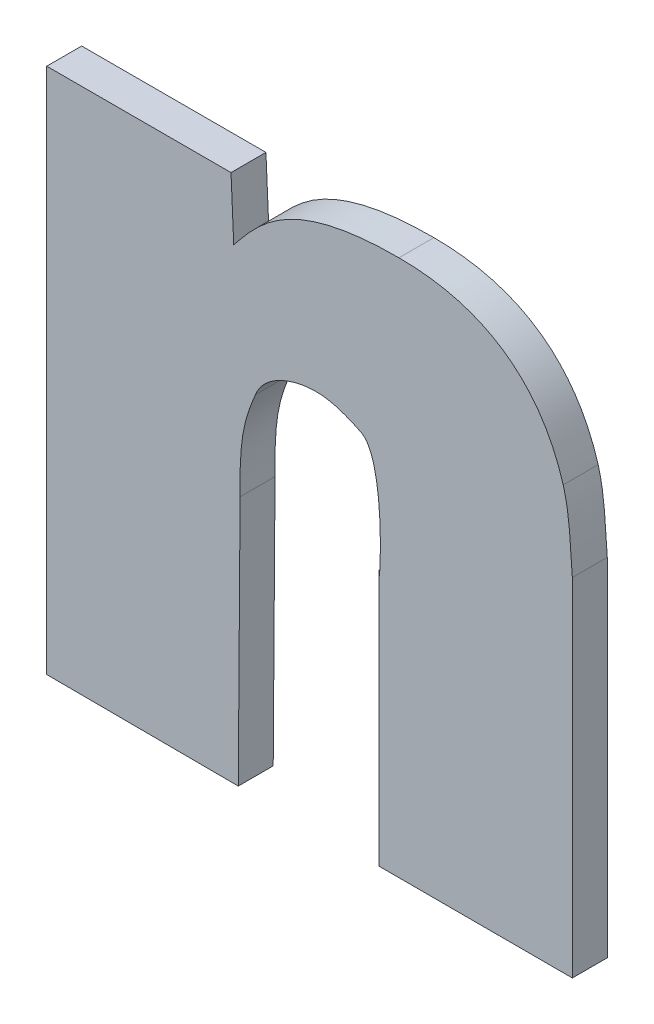
ISO-10303-21;
HEADER;
FILE_DESCRIPTION(('STEP AP214'),'2;1');
FILE_NAME('part.step','',(''),(''),'','','');
FILE_SCHEMA(('AUTOMOTIVE_DESIGN { 1 0 10303 214 1 1 1 1 }'));
ENDSEC;
DATA;
#1=APPLICATION_CONTEXT('core data for automotive mechanical design processes');
#2=APPLICATION_PROTOCOL_DEFINITION('international standard','automotive_design',2000,#1);
#3=PRODUCT_CONTEXT('',#1,'mechanical');
#4=PRODUCT('Part','Part','',(#3));
#5=PRODUCT_RELATED_PRODUCT_CATEGORY('part','',(#4));
#6=PRODUCT_DEFINITION_FORMATION('','',#4);
#7=PRODUCT_DEFINITION_CONTEXT('part definition',#1,'design');
#8=PRODUCT_DEFINITION('design','',#6,#7);
#9=PRODUCT_DEFINITION_SHAPE('','',#8);
#10=(LENGTH_UNIT() NAMED_UNIT(*) SI_UNIT(.MILLI.,.METRE.));
#11=(NAMED_UNIT(*) PLANE_ANGLE_UNIT() SI_UNIT($,.RADIAN.));
#12=(NAMED_UNIT(*) SI_UNIT($,.STERADIAN.) SOLID_ANGLE_UNIT());
#13=UNCERTAINTY_MEASURE_WITH_UNIT(LENGTH_MEASURE(1.E-05),#10,'distance_accuracy_value','');
#14=(GEOMETRIC_REPRESENTATION_CONTEXT(3) GLOBAL_UNCERTAINTY_ASSIGNED_CONTEXT((#13)) GLOBAL_UNIT_ASSIGNED_CONTEXT((#10,
#11,#12)) REPRESENTATION_CONTEXT('',''));
#15=CARTESIAN_POINT('',(0.,0.,0.));
#16=DIRECTION('',(0.,0.,1.));
#17=DIRECTION('',(1.,0.,0.));
#18=AXIS2_PLACEMENT_3D('',#15,#16,#17);
#19=CARTESIAN_POINT('',(0.173791677809616,-0.213912842174517,0.));
#20=DIRECTION('',(0.999973931858869,-0.0072204987857357,0.));
#21=DIRECTION('',(0.0072204987857357,0.999973931858869,0.));
#22=AXIS2_PLACEMENT_3D('',#19,#20,#21);
#23=PLANE('',#22);
#24=DIRECTION('',(0.0072204987857357,0.999973931858869,0.));
#25=VECTOR('',#24,1.);
#26=CARTESIAN_POINT('',(0.173791677809616,-0.213912842174517,0.));
#27=LINE('',#26,#25);
#28=CARTESIAN_POINT('',(0.173791677809616,-0.213912842174517,0.));
#29=VERTEX_POINT('',#28);
#30=CARTESIAN_POINT('',(0.173947567842768,-0.192323479165865,0.));
#31=VERTEX_POINT('',#30);
#32=EDGE_CURVE('E11',#29,#31,#27,.T.);
#33=ORIENTED_EDGE('',*,*,#32,.T.);
#34=DIRECTION('',(0.,0.,1.));
#35=VECTOR('',#34,1.);
#36=CARTESIAN_POINT('',(0.173947567842768,-0.192323479165865,0.));
#37=LINE('',#36,#35);
#38=CARTESIAN_POINT('',(0.173947567842768,-0.192323479165865,0.003));
#39=VERTEX_POINT('',#38);
#40=EDGE_CURVE('E24',#31,#39,#37,.T.);
#41=ORIENTED_EDGE('',*,*,#40,.T.);
#42=DIRECTION('',(0.0072204987857357,0.999973931858869,0.));
#43=VECTOR('',#42,1.);
#44=CARTESIAN_POINT('',(0.173791677809616,-0.213912842174517,0.003));
#45=LINE('',#44,#43);
#46=CARTESIAN_POINT('',(0.173791677809616,-0.213912842174517,0.003));
#47=VERTEX_POINT('',#46);
#48=EDGE_CURVE('E142',#47,#39,#45,.T.);
#49=ORIENTED_EDGE('',*,*,#48,.F.);
#50=DIRECTION('',(0.,0.,1.));
#51=VECTOR('',#50,1.);
#52=CARTESIAN_POINT('',(0.173791677809616,-0.213912842174517,0.));
#53=LINE('',#52,#51);
#54=EDGE_CURVE('E365',#29,#47,#53,.T.);
#55=ORIENTED_EDGE('',*,*,#54,.F.);
#56=EDGE_LOOP('',(#33,#41,#49,#55));
#57=FACE_BOUND('',#56,.T.);
#58=ADVANCED_FACE('F17',(#57),#23,.T.);
#59=CARTESIAN_POINT('',(0.157346359653284,-0.213842678823861,0.));
#60=DIRECTION('',(-0.0042664247304987,-0.999990898768593,0.));
#61=DIRECTION('',(0.999990898768593,-0.0042664247304987,0.));
#62=AXIS2_PLACEMENT_3D('',#59,#60,#61);
#63=PLANE('',#62);
#64=DIRECTION('',(0.999990898768593,-0.0042664247304987,0.));
#65=VECTOR('',#64,1.);
#66=CARTESIAN_POINT('',(0.157346359653284,-0.213842678823861,0.));
#67=LINE('',#66,#65);
#68=CARTESIAN_POINT('',(0.157346359653284,-0.213842678823861,0.));
#69=VERTEX_POINT('',#68);
#70=EDGE_CURVE('E362',#69,#29,#67,.T.);
#71=ORIENTED_EDGE('',*,*,#70,.T.);
#72=ORIENTED_EDGE('',*,*,#54,.T.);
#73=DIRECTION('',(0.999990898768593,-0.0042664247304987,0.));
#74=VECTOR('',#73,1.);
#75=CARTESIAN_POINT('',(0.157346359653284,-0.213842678823861,0.003));
#76=LINE('',#75,#74);
#77=CARTESIAN_POINT('',(0.157346359653284,-0.213842678823861,0.003));
#78=VERTEX_POINT('',#77);
#79=EDGE_CURVE('E360',#78,#47,#76,.T.);
#80=ORIENTED_EDGE('',*,*,#79,.F.);
#81=DIRECTION('',(0.,0.,1.));
#82=VECTOR('',#81,1.);
#83=CARTESIAN_POINT('',(0.157346359653284,-0.213842678823861,0.));
#84=LINE('',#83,#82);
#85=EDGE_CURVE('E357',#69,#78,#84,.T.);
#86=ORIENTED_EDGE('',*,*,#85,.F.);
#87=EDGE_LOOP('',(#71,#72,#80,#86));
#88=FACE_BOUND('',#87,.T.);
#89=ADVANCED_FACE('F449',(#88),#63,.T.);
#90=CARTESIAN_POINT('',(0.157346359653284,-0.168606341283553,0.));
#91=DIRECTION('',(-1.,0.,0.));
#92=DIRECTION('',(0.,-1.,0.));
#93=AXIS2_PLACEMENT_3D('',#90,#91,#92);
#94=PLANE('',#93);
#95=DIRECTION('',(0.,-1.,0.));
#96=VECTOR('',#95,1.);
#97=CARTESIAN_POINT('',(0.157346359653284,-0.168606341283553,0.));
#98=LINE('',#97,#96);
#99=CARTESIAN_POINT('',(0.157346359653284,-0.168606341283553,0.));
#100=VERTEX_POINT('',#99);
#101=EDGE_CURVE('E354',#100,#69,#98,.T.);
#102=ORIENTED_EDGE('',*,*,#101,.T.);
#103=ORIENTED_EDGE('',*,*,#85,.T.);
#104=DIRECTION('',(0.,-1.,0.));
#105=VECTOR('',#104,1.);
#106=CARTESIAN_POINT('',(0.157346359653284,-0.168606341283553,0.003));
#107=LINE('',#106,#105);
#108=CARTESIAN_POINT('',(0.157346359653284,-0.168606341283553,0.003));
#109=VERTEX_POINT('',#108);
#110=EDGE_CURVE('E351',#109,#78,#107,.T.);
#111=ORIENTED_EDGE('',*,*,#110,.F.);
#112=DIRECTION('',(0.,0.,1.));
#113=VECTOR('',#112,1.);
#114=CARTESIAN_POINT('',(0.157346359653284,-0.168606341283553,0.));
#115=LINE('',#114,#113);
#116=EDGE_CURVE('E348',#100,#109,#115,.T.);
#117=ORIENTED_EDGE('',*,*,#116,.F.);
#118=EDGE_LOOP('',(#102,#103,#111,#117));
#119=FACE_BOUND('',#118,.T.);
#120=ADVANCED_FACE('F453',(#119),#94,.T.);
#121=CARTESIAN_POINT('',(0.173168171159204,-0.168606341283553,0.));
#122=DIRECTION('',(0.,1.,0.));
#123=DIRECTION('',(-1.,0.,0.));
#124=AXIS2_PLACEMENT_3D('',#121,#122,#123);
#125=PLANE('',#124);
#126=DIRECTION('',(-1.,0.,0.));
#127=VECTOR('',#126,1.);
#128=CARTESIAN_POINT('',(0.173168171159204,-0.168606341283553,0.));
#129=LINE('',#128,#127);
#130=CARTESIAN_POINT('',(0.173168171159204,-0.168606341283553,0.));
#131=VERTEX_POINT('',#130);
#132=EDGE_CURVE('E345',#131,#100,#129,.T.);
#133=ORIENTED_EDGE('',*,*,#132,.T.);
#134=ORIENTED_EDGE('',*,*,#116,.T.);
#135=DIRECTION('',(-1.,0.,0.));
#136=VECTOR('',#135,1.);
#137=CARTESIAN_POINT('',(0.173168171159204,-0.168606341283553,0.003));
#138=LINE('',#137,#136);
#139=CARTESIAN_POINT('',(0.173168171159204,-0.168606341283553,0.003));
#140=VERTEX_POINT('',#139);
#141=EDGE_CURVE('E342',#140,#109,#138,.T.);
#142=ORIENTED_EDGE('',*,*,#141,.F.);
#143=DIRECTION('',(0.,0.,1.));
#144=VECTOR('',#143,1.);
#145=CARTESIAN_POINT('',(0.173168171159204,-0.168606341283553,0.));
#146=LINE('',#145,#144);
#147=EDGE_CURVE('E339',#131,#140,#146,.T.);
#148=ORIENTED_EDGE('',*,*,#147,.F.);
#149=EDGE_LOOP('',(#133,#134,#142,#148));
#150=FACE_BOUND('',#149,.T.);
#151=ADVANCED_FACE('F458',(#150),#125,.T.);
#152=CARTESIAN_POINT('',(0.173401979467901,-0.17385952199476,0.));
#153=DIRECTION('',(0.999010990304727,0.0444639320165016,0.));
#154=DIRECTION('',(-0.0444639320165016,0.999010990304727,0.));
#155=AXIS2_PLACEMENT_3D('',#152,#153,#154);
#156=PLANE('',#155);
#157=DIRECTION('',(-0.0444639320165016,0.999010990304727,0.));
#158=VECTOR('',#157,1.);
#159=CARTESIAN_POINT('',(0.173401979467901,-0.17385952199476,0.));
#160=LINE('',#159,#158);
#161=CARTESIAN_POINT('',(0.173401979467901,-0.17385952199476,0.));
#162=VERTEX_POINT('',#161);
#163=EDGE_CURVE('E336',#162,#131,#160,.T.);
#164=ORIENTED_EDGE('',*,*,#163,.T.);
#165=ORIENTED_EDGE('',*,*,#147,.T.);
#166=DIRECTION('',(-0.0444639320165016,0.999010990304727,0.));
#167=VECTOR('',#166,1.);
#168=CARTESIAN_POINT('',(0.173401979467901,-0.17385952199476,0.003));
#169=LINE('',#168,#167);
#170=CARTESIAN_POINT('',(0.173401979467901,-0.17385952199476,0.003));
#171=VERTEX_POINT('',#170);
#172=EDGE_CURVE('E333',#171,#140,#169,.T.);
#173=ORIENTED_EDGE('',*,*,#172,.F.);
#174=DIRECTION('',(0.,0.,1.));
#175=VECTOR('',#174,1.);
#176=CARTESIAN_POINT('',(0.173401979467901,-0.17385952199476,0.));
#177=LINE('',#176,#175);
#178=EDGE_CURVE('E330',#162,#171,#177,.T.);
#179=ORIENTED_EDGE('',*,*,#178,.F.);
#180=EDGE_LOOP('',(#164,#165,#173,#179));
#181=FACE_BOUND('',#180,.T.);
#182=ADVANCED_FACE('F463',(#181),#156,.T.);
#183=CARTESIAN_POINT('',(0.187587052590116,-0.167733414858721,0.));
#184=CARTESIAN_POINT('',(0.187587052590116,-0.167733414858721,0.003));
#185=CARTESIAN_POINT('',(0.178156287001613,-0.167733388760393,0.));
#186=CARTESIAN_POINT('',(0.178156287001613,-0.167733388760393,0.003));
#187=CARTESIAN_POINT('',(0.175584291551218,-0.171186157463009,0.));
#188=CARTESIAN_POINT('',(0.175584291551218,-0.171186157463009,0.003));
#189=CARTESIAN_POINT('',(0.173401979467901,-0.17385952199476,0.));
#190=CARTESIAN_POINT('',(0.173401979467901,-0.17385952199476,0.003));
#191=B_SPLINE_SURFACE_WITH_KNOTS('',3,1,((#183,#184),(#185,#186),(#187,#188),(#189,#190)),
.UNSPECIFIED.,.F.,.F.,.F.,(4,4),(2,2),(0.,1.),(0.,0.0003),.UNSPECIFIED.);
#192=CARTESIAN_POINT('',(0.187587052590116,-0.167733414858721,0.));
#193=CARTESIAN_POINT('',(0.178156287001613,-0.167733388760393,0.));
#194=CARTESIAN_POINT('',(0.175584291551218,-0.171186157463009,0.));
#195=CARTESIAN_POINT('',(0.173401979467901,-0.17385952199476,0.));
#196=B_SPLINE_CURVE_WITH_KNOTS('',3,(#192,#193,#194,#195),.UNSPECIFIED.,.F.,.F.,(4,4),(0.,1.),.UNSPECIFIED.);
#197=CARTESIAN_POINT('',(0.187587052590116,-0.167733414858721,0.));
#198=VERTEX_POINT('',#197);
#199=EDGE_CURVE('E320',#198,#162,#196,.T.);
#200=CARTESIAN_POINT('',(0.187587052590116,-0.167733414858721,0.003));
#201=CARTESIAN_POINT('',(0.178156287001613,-0.167733388760393,0.003));
#202=CARTESIAN_POINT('',(0.175584291551218,-0.171186157463009,0.003));
#203=CARTESIAN_POINT('',(0.173401979467901,-0.17385952199476,0.003));
#204=B_SPLINE_CURVE_WITH_KNOTS('',3,(#200,#201,#202,#203),.UNSPECIFIED.,.F.,.F.,(4,4),(0.,1.),.UNSPECIFIED.);
#205=CARTESIAN_POINT('',(0.187587052590116,-0.167733414858721,0.003));
#206=VERTEX_POINT('',#205);
#207=EDGE_CURVE('E310',#206,#171,#204,.T.);
#208=DIRECTION('',(0.,0.,1.));
#209=VECTOR('',#208,1.);
#210=CARTESIAN_POINT('',(0.187587052590116,-0.167733414858721,0.));
#211=LINE('',#210,#209);
#212=EDGE_CURVE('E308',#198,#206,#211,.T.);
#213=ORIENTED_EDGE('',*,*,#199,.T.);
#214=ORIENTED_EDGE('',*,*,#178,.T.);
#215=ORIENTED_EDGE('',*,*,#207,.F.);
#216=ORIENTED_EDGE('',*,*,#212,.F.);
#217=EDGE_LOOP('',(#213,#214,#215,#216));
#218=FACE_BOUND('',#217,.T.);
#219=ADVANCED_FACE('F276',(#218),#191,.T.);
#220=CARTESIAN_POINT('',(0.201694186044068,-0.177561664263861,0.));
#221=CARTESIAN_POINT('',(0.198722371782604,-0.167738028718736,0.));
#222=CARTESIAN_POINT('',(0.187587052590116,-0.167733414858721,0.));
#223=CARTESIAN_POINT('',(0.201694186044068,-0.177561664263861,0.003));
#224=CARTESIAN_POINT('',(0.198722371782604,-0.167738028718736,0.003));
#225=CARTESIAN_POINT('',(0.187587052590116,-0.167733414858721,0.003));
#226=(BOUNDED_SURFACE() B_SPLINE_SURFACE(1,2,((#220,#221,#222),(#223,#224,#225)),.UNSPECIFIED.,
.F.,.F.,.F.) B_SPLINE_SURFACE_WITH_KNOTS((2,2),(3,3),(0.,0.022054536354603),(-3.32996515341087,
-2.89830502874791),
.UNSPECIFIED.) GEOMETRIC_REPRESENTATION_ITEM() RATIONAL_B_SPLINE_SURFACE(((1.,0.976798965993403,
1.),(1.,0.976798965993403,1.))) REPRESENTATION_ITEM('') SURFACE());
#227=CARTESIAN_POINT('',(0.201694186044068,-0.177561664263861,0.));
#228=CARTESIAN_POINT('',(0.201634233766673,-0.17736348892105,0.));
#229=CARTESIAN_POINT('',(0.201571015714247,-0.177166285969513,0.));
#230=CARTESIAN_POINT('',(0.201438876756771,-0.176777515029229,0.));
#231=CARTESIAN_POINT('',(0.201370070210858,-0.176585908122934,0.));
#232=CARTESIAN_POINT('',(0.201226751800218,-0.176208398555631,0.));
#233=CARTESIAN_POINT('',(0.201152351059368,-0.176022453813029,0.));
#234=CARTESIAN_POINT('',(0.200997848030023,-0.175656345821434,0.));
#235=CARTESIAN_POINT('',(0.200917852385094,-0.175476137632119,0.));
#236=CARTESIAN_POINT('',(0.200752167108274,-0.175121573790298,0.));
#237=CARTESIAN_POINT('',(0.200666578392743,-0.174947171051631,0.));
#238=CARTESIAN_POINT('',(0.200489719038048,-0.174604286319832,0.));
#239=CARTESIAN_POINT('',(0.20039854232631,-0.174435755943161,0.));
#240=CARTESIAN_POINT('',(0.200210523376613,-0.174104680087691,0.));
#241=CARTESIAN_POINT('',(0.200113766860506,-0.173942085985452,0.));
#242=CARTESIAN_POINT('',(0.199914609028724,-0.17362294275547,0.));
#243=CARTESIAN_POINT('',(0.199812284108262,-0.173466346004437,0.));
#244=CARTESIAN_POINT('',(0.199602014400521,-0.173159253160363,0.));
#245=CARTESIAN_POINT('',(0.199494135714552,-0.173008711848513,0.));
#246=CARTESIAN_POINT('',(0.199272787442436,-0.172713780968521,0.));
#247=CARTESIAN_POINT('',(0.19915937290716,-0.172569350116141,0.));
#248=CARTESIAN_POINT('',(0.198926985698329,-0.172286686462698,0.));
#249=CARTESIAN_POINT('',(0.198808056531271,-0.172148417915907,0.));
#250=CARTESIAN_POINT('',(0.198564676322972,-0.171878120289245,0.));
#251=CARTESIAN_POINT('',(0.19844025705368,-0.17174606261504,0.));
#252=CARTESIAN_POINT('',(0.198185936071005,-0.17148822321475,0.));
#253=CARTESIAN_POINT('',(0.198056054534102,-0.171362421593905,0.));
#254=CARTESIAN_POINT('',(0.19779085125094,-0.171117125885815,0.));
#255=CARTESIAN_POINT('',(0.197655538559974,-0.170997622009956,0.));
#256=CARTESIAN_POINT('',(0.197379517642623,-0.170764948602461,0.));
#257=CARTESIAN_POINT('',(0.197238808144256,-0.170651780579785,0.));
#258=CARTESIAN_POINT('',(0.196952040378308,-0.170431801112182,0.));
#259=CARTESIAN_POINT('',(0.196805971588316,-0.170325003386769,0.));
#260=CARTESIAN_POINT('',(0.19650853379045,-0.170117782432406,0.));
#261=CARTESIAN_POINT('',(0.196357146314598,-0.170017385721022,0.));
#262=CARTESIAN_POINT('',(0.196049121231678,-0.169822980707374,0.));
#263=CARTESIAN_POINT('',(0.195892458675811,-0.169729011956291,0.));
#264=CARTESIAN_POINT('',(0.195573934874142,-0.16954747310325,0.));
#265=CARTESIAN_POINT('',(0.195412043748419,-0.169459955465816,0.));
#266=CARTESIAN_POINT('',(0.195083115496115,-0.169291325742524,0.));
#267=CARTESIAN_POINT('',(0.194916045118218,-0.169210278576436,0.));
#268=CARTESIAN_POINT('',(0.194576812263357,-0.169054593676059,0.));
#269=CARTESIAN_POINT('',(0.194404614664775,-0.168980032557802,0.));
#270=CARTESIAN_POINT('',(0.194055182511428,-0.168837320888891,0.));
#271=CARTESIAN_POINT('',(0.193877912349689,-0.168769257641847,0.));
#272=CARTESIAN_POINT('',(0.193518391533271,-0.1686395403344,0.));
#273=CARTESIAN_POINT('',(0.193336106011772,-0.168577983066633,0.));
#274=CARTESIAN_POINT('',(0.192966612374024,-0.168461273990986,0.));
#275=CARTESIAN_POINT('',(0.192779371169261,-0.1684062271392,0.));
#276=CARTESIAN_POINT('',(0.192400025633945,-0.168302532935137,0.));
#277=CARTESIAN_POINT('',(0.192207890830889,-0.168253997310679,0.));
#278=CARTESIAN_POINT('',(0.191818819275241,-0.168163317427545,0.));
#279=CARTESIAN_POINT('',(0.1916218553032,-0.16812129026555,0.));
#280=CARTESIAN_POINT('',(0.191223188441014,-0.168043617002576,0.));
#281=CARTESIAN_POINT('',(0.191021462031371,-0.168008091999528,0.));
#282=CARTESIAN_POINT('',(0.19061333524264,-0.167943410581756,0.));
#283=CARTESIAN_POINT('',(0.190406915317209,-0.167914377971346,0.));
#284=CARTESIAN_POINT('',(0.189989468668674,-0.167862666521735,0.));
#285=CARTESIAN_POINT('',(0.189778426498903,-0.1678401129953,0.));
#286=CARTESIAN_POINT('',(0.189351804014857,-0.167801342935044,0.));
#287=CARTESIAN_POINT('',(0.189136212339135,-0.167785252149602,0.));
#288=CARTESIAN_POINT('',(0.188700564125664,-0.167759386985906,0.));
#289=CARTESIAN_POINT('',(0.188480500254131,-0.167749737811803,0.));
#290=CARTESIAN_POINT('',(0.188035973650009,-0.16773673814305,0.));
#291=CARTESIAN_POINT('',(0.187811507248405,-0.16773351158587,0.));
#292=CARTESIAN_POINT('',(0.187587052590116,-0.167733414858721,0.));
#293=B_SPLINE_CURVE_WITH_KNOTS('',3,(#227,#228,#229,#230,#231,#232,#233,#234,#235,#236,#237,
#238,#239,#240,#241,#242,#243,#244,#245,#246,#247,#248,#249,#250,#251,#252,#253,#254,#255,#256,
#257,#258,#259,#260,#261,#262,#263,#264,#265,#266,#267,#268,#269,#270,#271,#272,#273,#274,#275,
#276,#277,#278,#279,#280,#281,#282,#283,#284,#285,#286,#287,#288,#289,#290,#291,#292),
.UNSPECIFIED.,.F.,.F.,(4,2,2,2,2,2,2,2,2,2,2,2,2,2,2,2,2,2,2,2,2,2,2,2,2,2,2,2,2,2,2,2,4),(0.,
0.000621129519871471,0.00123176787613545,0.00183246466256551,0.0024238210474888,
0.00300648974966258,0.00358117437163157,0.00414862800011991,0.0047096509955389,
0.00526508791319006,0.00581582352740597,0.00636277796598129,0.0069069010039649,
0.00744916561026782,0.00799056088375965,0.00853208455329423,0.0090747352443111,
0.00961950473003859,0.0101673703860383,0.0107192880528049,0.0112761854840869,0.0118389565216794,
0.0124084560947336,0.0129854960973935,0.0135708421566948,0.014165211266141,0.0147692702311328,
0.0153836348512722,0.0160088697513552,0.0166454887667698,0.0172939557887883,0.0179546859794519,
0.0186280472730226),.UNSPECIFIED.);
#294=CARTESIAN_POINT('',(0.201694186044068,-0.177561664263861,0.));
#295=VERTEX_POINT('',#294);
#296=EDGE_CURVE('E305',#295,#198,#293,.T.);
#297=CARTESIAN_POINT('',(0.187587052590116,-0.167733414858721,0.003));
#298=CARTESIAN_POINT('',(0.198722371782604,-0.167738028718736,0.003));
#299=CARTESIAN_POINT('',(0.201694186044068,-0.177561664263861,0.003));
#300=(BOUNDED_CURVE() B_SPLINE_CURVE(2,(#297,#298,#299),.UNSPECIFIED.,.F.,
.F.) B_SPLINE_CURVE_WITH_KNOTS((3,3),(-3.32996515341087,-2.89830502874791),
.UNSPECIFIED.) CURVE() GEOMETRIC_REPRESENTATION_ITEM() RATIONAL_B_SPLINE_CURVE((1.,
0.976798965993403,1.)) REPRESENTATION_ITEM(''));
#301=CARTESIAN_POINT('',(0.201694186044068,-0.177561664263861,0.003));
#302=VERTEX_POINT('',#301);
#303=EDGE_CURVE('E256',#302,#206,#300,.F.);
#304=DIRECTION('',(0.,0.,1.));
#305=VECTOR('',#304,1.);
#306=CARTESIAN_POINT('',(0.201694186044068,-0.177561664263861,0.));
#307=LINE('',#306,#305);
#308=EDGE_CURVE('E252',#295,#302,#307,.T.);
#309=ORIENTED_EDGE('',*,*,#296,.T.);
#310=ORIENTED_EDGE('',*,*,#212,.T.);
#311=ORIENTED_EDGE('',*,*,#303,.F.);
#312=ORIENTED_EDGE('',*,*,#308,.F.);
#313=EDGE_LOOP('',(#309,#310,#311,#312));
#314=FACE_BOUND('',#313,.T.);
#315=ADVANCED_FACE('F263',(#314),#226,.F.);
#316=CARTESIAN_POINT('',(0.20247357203114,-0.184061847579433,0.));
#317=CARTESIAN_POINT('',(0.20247357203114,-0.184061847579433,0.003));
#318=CARTESIAN_POINT('',(0.202239755540968,-0.180461009889864,0.));
#319=CARTESIAN_POINT('',(0.202239755540968,-0.180461009889864,0.003));
#320=CARTESIAN_POINT('',(0.2021618234619,-0.179315302859394,0.));
#321=CARTESIAN_POINT('',(0.2021618234619,-0.179315302859394,0.003));
#322=CARTESIAN_POINT('',(0.201694186044068,-0.177561664263861,0.));
#323=CARTESIAN_POINT('',(0.201694186044068,-0.177561664263861,0.003));
#324=B_SPLINE_SURFACE_WITH_KNOTS('',3,1,((#316,#317),(#318,#319),(#320,#321),(#322,#323)),
.UNSPECIFIED.,.F.,.F.,.F.,(4,4),(2,2),(0.,1.),(0.,0.0003),.UNSPECIFIED.);
#325=CARTESIAN_POINT('',(0.20247357203114,-0.184061847579433,0.));
#326=CARTESIAN_POINT('',(0.202239755540968,-0.180461009889864,0.));
#327=CARTESIAN_POINT('',(0.2021618234619,-0.179315302859394,0.));
#328=CARTESIAN_POINT('',(0.201694186044068,-0.177561664263861,0.));
#329=B_SPLINE_CURVE_WITH_KNOTS('',3,(#325,#326,#327,#328),.UNSPECIFIED.,.F.,.F.,(4,4),(0.,1.),.UNSPECIFIED.);
#330=CARTESIAN_POINT('',(0.20247357203114,-0.184061847579433,0.));
#331=VERTEX_POINT('',#330);
#332=EDGE_CURVE('E242',#331,#295,#329,.T.);
#333=CARTESIAN_POINT('',(0.20247357203114,-0.184061847579433,0.003));
#334=CARTESIAN_POINT('',(0.202239755540968,-0.180461009889864,0.003));
#335=CARTESIAN_POINT('',(0.2021618234619,-0.179315302859394,0.003));
#336=CARTESIAN_POINT('',(0.201694186044068,-0.177561664263861,0.003));
#337=B_SPLINE_CURVE_WITH_KNOTS('',3,(#333,#334,#335,#336),.UNSPECIFIED.,.F.,.F.,(4,4),(0.,1.),.UNSPECIFIED.);
#338=CARTESIAN_POINT('',(0.20247357203114,-0.184061847579433,0.003));
#339=VERTEX_POINT('',#338);
#340=EDGE_CURVE('E232',#339,#302,#337,.T.);
#341=DIRECTION('',(0.,0.,1.));
#342=VECTOR('',#341,1.);
#343=CARTESIAN_POINT('',(0.20247357203114,-0.184061847579433,0.));
#344=LINE('',#343,#342);
#345=EDGE_CURVE('E229',#331,#339,#344,.T.);
#346=ORIENTED_EDGE('',*,*,#332,.T.);
#347=ORIENTED_EDGE('',*,*,#308,.T.);
#348=ORIENTED_EDGE('',*,*,#340,.F.);
#349=ORIENTED_EDGE('',*,*,#345,.F.);
#350=EDGE_LOOP('',(#346,#347,#348,#349));
#351=FACE_BOUND('',#350,.T.);
#352=ADVANCED_FACE('F275',(#351),#324,.T.);
#353=CARTESIAN_POINT('',(0.20247357203114,-0.213842678823861,0.));
#354=DIRECTION('',(1.,0.,0.));
#355=DIRECTION('',(0.,1.,0.));
#356=AXIS2_PLACEMENT_3D('',#353,#354,#355);
#357=PLANE('',#356);
#358=DIRECTION('',(0.,1.,0.));
#359=VECTOR('',#358,1.);
#360=CARTESIAN_POINT('',(0.20247357203114,-0.213842678823861,0.));
#361=LINE('',#360,#359);
#362=CARTESIAN_POINT('',(0.20247357203114,-0.213842678823861,0.));
#363=VERTEX_POINT('',#362);
#364=EDGE_CURVE('E226',#363,#331,#361,.T.);
#365=ORIENTED_EDGE('',*,*,#364,.T.);
#366=ORIENTED_EDGE('',*,*,#345,.T.);
#367=DIRECTION('',(0.,1.,0.));
#368=VECTOR('',#367,1.);
#369=CARTESIAN_POINT('',(0.20247357203114,-0.213842678823861,0.003));
#370=LINE('',#369,#368);
#371=CARTESIAN_POINT('',(0.20247357203114,-0.213842678823861,0.003));
#372=VERTEX_POINT('',#371);
#373=EDGE_CURVE('E223',#372,#339,#370,.T.);
#374=ORIENTED_EDGE('',*,*,#373,.F.);
#375=DIRECTION('',(0.,0.,1.));
#376=VECTOR('',#375,1.);
#377=CARTESIAN_POINT('',(0.20247357203114,-0.213842678823861,0.));
#378=LINE('',#377,#376);
#379=EDGE_CURVE('E220',#363,#372,#378,.T.);
#380=ORIENTED_EDGE('',*,*,#379,.F.);
#381=EDGE_LOOP('',(#365,#366,#374,#380));
#382=FACE_BOUND('',#381,.T.);
#383=ADVANCED_FACE('F383',(#382),#357,.T.);
#384=CARTESIAN_POINT('',(0.185872374538148,-0.213827110143841,0.));
#385=DIRECTION('',(-0.000937804226449666,-0.99999956026152,0.));
#386=DIRECTION('',(0.99999956026152,-0.000937804226449666,0.));
#387=AXIS2_PLACEMENT_3D('',#384,#385,#386);
#388=PLANE('',#387);
#389=DIRECTION('',(0.99999956026152,-0.000937804226449666,0.));
#390=VECTOR('',#389,1.);
#391=CARTESIAN_POINT('',(0.185872374538148,-0.213827110143841,0.));
#392=LINE('',#391,#390);
#393=CARTESIAN_POINT('',(0.185872374538148,-0.213827110143841,0.));
#394=VERTEX_POINT('',#393);
#395=EDGE_CURVE('E217',#394,#363,#392,.T.);
#396=ORIENTED_EDGE('',*,*,#395,.T.);
#397=ORIENTED_EDGE('',*,*,#379,.T.);
#398=DIRECTION('',(0.99999956026152,-0.000937804226449666,0.));
#399=VECTOR('',#398,1.);
#400=CARTESIAN_POINT('',(0.185872374538148,-0.213827110143841,0.003));
#401=LINE('',#400,#399);
#402=CARTESIAN_POINT('',(0.185872374538148,-0.213827110143841,0.003));
#403=VERTEX_POINT('',#402);
#404=EDGE_CURVE('E214',#403,#372,#401,.T.);
#405=ORIENTED_EDGE('',*,*,#404,.F.);
#406=DIRECTION('',(0.,0.,1.));
#407=VECTOR('',#406,1.);
#408=CARTESIAN_POINT('',(0.185872374538148,-0.213827110143841,0.));
#409=LINE('',#408,#407);
#410=EDGE_CURVE('E211',#394,#403,#409,.T.);
#411=ORIENTED_EDGE('',*,*,#410,.F.);
#412=EDGE_LOOP('',(#396,#397,#405,#411));
#413=FACE_BOUND('',#412,.T.);
#414=ADVANCED_FACE('F379',(#413),#388,.T.);
#415=CARTESIAN_POINT('',(0.185872374538148,-0.1918324533722,0.));
#416=DIRECTION('',(-1.,0.,0.));
#417=DIRECTION('',(0.,-1.,0.));
#418=AXIS2_PLACEMENT_3D('',#415,#416,#417);
#419=PLANE('',#418);
#420=DIRECTION('',(0.,-1.,0.));
#421=VECTOR('',#420,1.);
#422=CARTESIAN_POINT('',(0.185872374538148,-0.1918324533722,0.));
#423=LINE('',#422,#421);
#424=CARTESIAN_POINT('',(0.185872374538148,-0.1918324533722,0.));
#425=VERTEX_POINT('',#424);
#426=EDGE_CURVE('E208',#425,#394,#423,.T.);
#427=ORIENTED_EDGE('',*,*,#426,.T.);
#428=ORIENTED_EDGE('',*,*,#410,.T.);
#429=DIRECTION('',(0.,-1.,0.));
#430=VECTOR('',#429,1.);
#431=CARTESIAN_POINT('',(0.185872374538148,-0.1918324533722,0.003));
#432=LINE('',#431,#430);
#433=CARTESIAN_POINT('',(0.185872374538148,-0.1918324533722,0.003));
#434=VERTEX_POINT('',#433);
#435=EDGE_CURVE('E205',#434,#403,#432,.T.);
#436=ORIENTED_EDGE('',*,*,#435,.F.);
#437=DIRECTION('',(0.,0.,1.));
#438=VECTOR('',#437,1.);
#439=CARTESIAN_POINT('',(0.185872374538148,-0.1918324533722,0.));
#440=LINE('',#439,#438);
#441=EDGE_CURVE('E199',#425,#434,#440,.T.);
#442=ORIENTED_EDGE('',*,*,#441,.F.);
#443=EDGE_LOOP('',(#427,#428,#436,#442));
#444=FACE_BOUND('',#443,.T.);
#445=ADVANCED_FACE('F376',(#444),#419,.T.);
#446=CARTESIAN_POINT('',(0.18431357047466,-0.182331568758056,0.));
#447=CARTESIAN_POINT('',(0.18431357047466,-0.182331568758056,0.003));
#448=CARTESIAN_POINT('',(0.186651750052431,-0.183438317074046,0.));
#449=CARTESIAN_POINT('',(0.186651750052431,-0.183438317074046,0.003));
#450=CARTESIAN_POINT('',(0.185872382761754,-0.194435642573713,0.));
#451=CARTESIAN_POINT('',(0.185872382761754,-0.194435642573713,0.003));
#452=CARTESIAN_POINT('',(0.185872374538148,-0.1918324533722,0.));
#453=CARTESIAN_POINT('',(0.185872374538148,-0.1918324533722,0.003));
#454=B_SPLINE_SURFACE_WITH_KNOTS('',3,1,((#446,#447),(#448,#449),(#450,#451),(#452,#453)),
.UNSPECIFIED.,.F.,.F.,.F.,(4,4),(2,2),(0.,1.),(0.,0.0003),.UNSPECIFIED.);
#455=CARTESIAN_POINT('',(0.18431357047466,-0.182331568758056,0.));
#456=CARTESIAN_POINT('',(0.186651750052431,-0.183438317074046,0.));
#457=CARTESIAN_POINT('',(0.185872382761754,-0.194435642573713,0.));
#458=CARTESIAN_POINT('',(0.185872374538148,-0.1918324533722,0.));
#459=B_SPLINE_CURVE_WITH_KNOTS('',3,(#455,#456,#457,#458),.UNSPECIFIED.,.F.,.F.,(4,4),(0.,1.),.UNSPECIFIED.);
#460=CARTESIAN_POINT('',(0.18431357047466,-0.182331568758056,0.));
#461=VERTEX_POINT('',#460);
#462=EDGE_CURVE('E191',#461,#425,#459,.T.);
#463=CARTESIAN_POINT('',(0.18431357047466,-0.182331568758056,0.003));
#464=CARTESIAN_POINT('',(0.186651750052431,-0.183438317074046,0.003));
#465=CARTESIAN_POINT('',(0.185872382761754,-0.194435642573713,0.003));
#466=CARTESIAN_POINT('',(0.185872374538148,-0.1918324533722,0.003));
#467=B_SPLINE_CURVE_WITH_KNOTS('',3,(#463,#464,#465,#466),.UNSPECIFIED.,.F.,.F.,(4,4),(0.,1.),.UNSPECIFIED.);
#468=CARTESIAN_POINT('',(0.18431357047466,-0.182331568758056,0.003));
#469=VERTEX_POINT('',#468);
#470=EDGE_CURVE('E186',#469,#434,#467,.T.);
#471=DIRECTION('',(0.,0.,1.));
#472=VECTOR('',#471,1.);
#473=CARTESIAN_POINT('',(0.18431357047466,-0.182331568758056,0.));
#474=LINE('',#473,#472);
#475=EDGE_CURVE('E180',#461,#469,#474,.T.);
#476=CARTESIAN_POINT('',(0.18431357047466,-0.182331568758056,0.));
#477=CARTESIAN_POINT('',(0.18431357047466,-0.182331568758056,0.003));
#478=CARTESIAN_POINT('',(0.186651750052431,-0.183438317074046,0.));
#479=CARTESIAN_POINT('',(0.186651750052431,-0.183438317074046,0.003));
#480=CARTESIAN_POINT('',(0.185872382761754,-0.194435642573713,0.));
#481=CARTESIAN_POINT('',(0.185872382761754,-0.194435642573713,0.003));
#482=CARTESIAN_POINT('',(0.185872374538148,-0.1918324533722,0.));
#483=CARTESIAN_POINT('',(0.185872374538148,-0.1918324533722,0.003));
#484=CARTESIAN_POINT('',(0.185872373872036,-0.191621595046877,0.));
#485=CARTESIAN_POINT('',(0.185872373872036,-0.191621595046877,0.003));
#486=CARTESIAN_POINT('',(0.185872373205924,-0.191410736721555,0.));
#487=CARTESIAN_POINT('',(0.185872373205924,-0.191410736721555,0.003));
#488=CARTESIAN_POINT('',(0.185872372539812,-0.191199878396232,0.));
#489=CARTESIAN_POINT('',(0.185872372539812,-0.191199878396232,0.003));
#490=B_SPLINE_SURFACE_WITH_KNOTS('',3,1,((#476,#477),(#478,#479),(#480,#481),(#482,#483),(#484,
#485),(#486,#487),(#488,#489)),.UNSPECIFIED.,.F.,.F.,.F.,(4,3,4),(2,2),(0.,1.,1.081),(0.,
0.0003),.UNSPECIFIED.);
#491=ORIENTED_EDGE('',*,*,#462,.T.);
#492=ORIENTED_EDGE('',*,*,#441,.T.);
#493=ORIENTED_EDGE('',*,*,#470,.F.);
#494=ORIENTED_EDGE('',*,*,#475,.F.);
#495=EDGE_LOOP('',(#491,#492,#493,#494));
#496=FACE_BOUND('',#495,.T.);
#497=ADVANCED_FACE('F373',(#496),#490,.T.);
#498=CARTESIAN_POINT('',(0.180338631344036,-0.181240429445801,0.));
#499=CARTESIAN_POINT('',(0.180338631344036,-0.181240429445801,0.003));
#500=CARTESIAN_POINT('',(0.182053307341513,-0.181201445001865,0.));
#501=CARTESIAN_POINT('',(0.182053307341513,-0.181201445001865,0.003));
#502=CARTESIAN_POINT('',(0.183534183821649,-0.181965264964949,0.));
#503=CARTESIAN_POINT('',(0.183534183821649,-0.181965264964949,0.003));
#504=CARTESIAN_POINT('',(0.18431357047466,-0.182331568758056,0.));
#505=CARTESIAN_POINT('',(0.18431357047466,-0.182331568758056,0.003));
#506=B_SPLINE_SURFACE_WITH_KNOTS('',3,1,((#498,#499),(#500,#501),(#502,#503),(#504,#505)),
.UNSPECIFIED.,.F.,.F.,.F.,(4,4),(2,2),(0.,1.),(0.,0.0003),.UNSPECIFIED.);
#507=CARTESIAN_POINT('',(0.180338631344036,-0.181240429445801,0.));
#508=CARTESIAN_POINT('',(0.182053307341513,-0.181201445001865,0.));
#509=CARTESIAN_POINT('',(0.183534183821649,-0.181965264964949,0.));
#510=CARTESIAN_POINT('',(0.18431357047466,-0.182331568758056,0.));
#511=B_SPLINE_CURVE_WITH_KNOTS('',3,(#507,#508,#509,#510),.UNSPECIFIED.,.F.,.F.,(4,4),(0.,1.),.UNSPECIFIED.);
#512=CARTESIAN_POINT('',(0.180338631344036,-0.181240429445801,0.));
#513=VERTEX_POINT('',#512);
#514=EDGE_CURVE('E172',#513,#461,#511,.T.);
#515=CARTESIAN_POINT('',(0.180338631344036,-0.181240429445801,0.003));
#516=CARTESIAN_POINT('',(0.182053307341513,-0.181201445001865,0.003));
#517=CARTESIAN_POINT('',(0.183534183821649,-0.181965264964949,0.003));
#518=CARTESIAN_POINT('',(0.18431357047466,-0.182331568758056,0.003));
#519=B_SPLINE_CURVE_WITH_KNOTS('',3,(#515,#516,#517,#518),.UNSPECIFIED.,.F.,.F.,(4,4),(0.,1.),.UNSPECIFIED.);
#520=CARTESIAN_POINT('',(0.180338631344036,-0.181240429445801,0.003));
#521=VERTEX_POINT('',#520);
#522=EDGE_CURVE('E168',#521,#469,#519,.T.);
#523=DIRECTION('',(0.,0.,1.));
#524=VECTOR('',#523,1.);
#525=CARTESIAN_POINT('',(0.180338631344036,-0.181240429445801,0.));
#526=LINE('',#525,#524);
#527=EDGE_CURVE('E127',#513,#521,#526,.T.);
#528=ORIENTED_EDGE('',*,*,#514,.T.);
#529=ORIENTED_EDGE('',*,*,#475,.T.);
#530=ORIENTED_EDGE('',*,*,#522,.F.);
#531=ORIENTED_EDGE('',*,*,#527,.F.);
#532=EDGE_LOOP('',(#528,#529,#530,#531));
#533=FACE_BOUND('',#532,.T.);
#534=ADVANCED_FACE('F371',(#533),#506,.T.);
#535=CARTESIAN_POINT('',(0.175272536856528,-0.184061847579433,0.));
#536=CARTESIAN_POINT('',(0.175272536856528,-0.184061847579433,0.003));
#537=CARTESIAN_POINT('',(0.175973999424551,-0.182261461233878,0.));
#538=CARTESIAN_POINT('',(0.175973999424551,-0.182261461233878,0.003));
#539=CARTESIAN_POINT('',(0.178312194830649,-0.181279396930221,0.));
#540=CARTESIAN_POINT('',(0.178312194830649,-0.181279396930221,0.003));
#541=CARTESIAN_POINT('',(0.180338631344036,-0.181240429445801,0.));
#542=CARTESIAN_POINT('',(0.180338631344036,-0.181240429445801,0.003));
#543=B_SPLINE_SURFACE_WITH_KNOTS('',3,1,((#535,#536),(#537,#538),(#539,#540),(#541,#542)),
.UNSPECIFIED.,.F.,.F.,.F.,(4,4),(2,2),(0.,1.),(0.,0.0003),.UNSPECIFIED.);
#544=CARTESIAN_POINT('',(0.175272536856528,-0.184061847579433,0.));
#545=CARTESIAN_POINT('',(0.175973999424551,-0.182261461233878,0.));
#546=CARTESIAN_POINT('',(0.178312194830649,-0.181279396930221,0.));
#547=CARTESIAN_POINT('',(0.180338631344036,-0.181240429445801,0.));
#548=B_SPLINE_CURVE_WITH_KNOTS('',3,(#544,#545,#546,#547),.UNSPECIFIED.,.F.,.F.,(4,4),(0.,1.),.UNSPECIFIED.);
#549=CARTESIAN_POINT('',(0.175272536856528,-0.184061847579433,0.));
#550=VERTEX_POINT('',#549);
#551=EDGE_CURVE('E131',#550,#513,#548,.T.);
#552=CARTESIAN_POINT('',(0.175272536856528,-0.184061847579433,0.003));
#553=CARTESIAN_POINT('',(0.175973999424551,-0.182261461233878,0.003));
#554=CARTESIAN_POINT('',(0.178312194830649,-0.181279396930221,0.003));
#555=CARTESIAN_POINT('',(0.180338631344036,-0.181240429445801,0.003));
#556=B_SPLINE_CURVE_WITH_KNOTS('',3,(#552,#553,#554,#555),.UNSPECIFIED.,.F.,.F.,(4,4),(0.,1.),.UNSPECIFIED.);
#557=CARTESIAN_POINT('',(0.175272536856528,-0.184061847579433,0.003));
#558=VERTEX_POINT('',#557);
#559=EDGE_CURVE('E120',#558,#521,#556,.T.);
#560=DIRECTION('',(0.,0.,1.));
#561=VECTOR('',#560,1.);
#562=CARTESIAN_POINT('',(0.175272536856528,-0.184061847579433,0.));
#563=LINE('',#562,#561);
#564=EDGE_CURVE('E124',#550,#558,#563,.T.);
#565=ORIENTED_EDGE('',*,*,#551,.T.);
#566=ORIENTED_EDGE('',*,*,#527,.T.);
#567=ORIENTED_EDGE('',*,*,#559,.F.);
#568=ORIENTED_EDGE('',*,*,#564,.F.);
#569=EDGE_LOOP('',(#565,#566,#567,#568));
#570=FACE_BOUND('',#569,.T.);
#571=ADVANCED_FACE('F123',(#570),#543,.T.);
#572=CARTESIAN_POINT('',(0.173947567842768,-0.192323479165865,0.));
#573=CARTESIAN_POINT('',(0.173947567842768,-0.192323479165865,0.003));
#574=CARTESIAN_POINT('',(0.173869625317486,-0.187756193083948,0.));
#575=CARTESIAN_POINT('',(0.173869625317486,-0.187756193083948,0.003));
#576=CARTESIAN_POINT('',(0.174337256970287,-0.186259754345192,0.));
#577=CARTESIAN_POINT('',(0.174337256970287,-0.186259754345192,0.003));
#578=CARTESIAN_POINT('',(0.175272536856528,-0.184061847579433,0.));
#579=CARTESIAN_POINT('',(0.175272536856528,-0.184061847579433,0.003));
#580=B_SPLINE_SURFACE_WITH_KNOTS('',3,1,((#572,#573),(#574,#575),(#576,#577),(#578,#579)),
.UNSPECIFIED.,.F.,.F.,.F.,(4,4),(2,2),(0.,1.),(0.,0.0003),.UNSPECIFIED.);
#581=CARTESIAN_POINT('',(0.173947567842768,-0.192323479165865,0.));
#582=CARTESIAN_POINT('',(0.173869625317486,-0.187756193083948,0.));
#583=CARTESIAN_POINT('',(0.174337256970287,-0.186259754345192,0.));
#584=CARTESIAN_POINT('',(0.175272536856528,-0.184061847579433,0.));
#585=B_SPLINE_CURVE_WITH_KNOTS('',3,(#581,#582,#583,#584),.UNSPECIFIED.,.F.,.F.,(4,4),(0.,1.),.UNSPECIFIED.);
#586=EDGE_CURVE('E137',#31,#550,#585,.T.);
#587=CARTESIAN_POINT('',(0.173947567842768,-0.192323479165865,0.003));
#588=CARTESIAN_POINT('',(0.173869625317486,-0.187756193083948,0.003));
#589=CARTESIAN_POINT('',(0.174337256970287,-0.186259754345192,0.003));
#590=CARTESIAN_POINT('',(0.175272536856528,-0.184061847579433,0.003));
#591=B_SPLINE_CURVE_WITH_KNOTS('',3,(#587,#588,#589,#590),.UNSPECIFIED.,.F.,.F.,(4,4),(0.,1.),.UNSPECIFIED.);
#592=EDGE_CURVE('E136',#39,#558,#591,.T.);
#593=ORIENTED_EDGE('',*,*,#586,.T.);
#594=ORIENTED_EDGE('',*,*,#564,.T.);
#595=ORIENTED_EDGE('',*,*,#592,.F.);
#596=ORIENTED_EDGE('',*,*,#40,.F.);
#597=EDGE_LOOP('',(#593,#594,#595,#596));
#598=FACE_BOUND('',#597,.T.);
#599=ADVANCED_FACE('F135',(#598),#580,.T.);
#600=CARTESIAN_POINT('',(0.179909965842212,-0.190823115467455,0.003));
#601=DIRECTION('',(0.,0.,1.));
#602=DIRECTION('',(1.,0.,0.));
#603=AXIS2_PLACEMENT_3D('',#600,#601,#602);
#604=PLANE('',#603);
#605=ORIENTED_EDGE('',*,*,#592,.T.);
#606=ORIENTED_EDGE('',*,*,#559,.T.);
#607=ORIENTED_EDGE('',*,*,#522,.T.);
#608=ORIENTED_EDGE('',*,*,#470,.T.);
#609=ORIENTED_EDGE('',*,*,#435,.T.);
#610=ORIENTED_EDGE('',*,*,#404,.T.);
#611=ORIENTED_EDGE('',*,*,#373,.T.);
#612=ORIENTED_EDGE('',*,*,#340,.T.);
#613=ORIENTED_EDGE('',*,*,#303,.T.);
#614=ORIENTED_EDGE('',*,*,#207,.T.);
#615=ORIENTED_EDGE('',*,*,#172,.T.);
#616=ORIENTED_EDGE('',*,*,#141,.T.);
#617=ORIENTED_EDGE('',*,*,#110,.T.);
#618=ORIENTED_EDGE('',*,*,#79,.T.);
#619=ORIENTED_EDGE('',*,*,#48,.T.);
#620=EDGE_LOOP('',(#605,#606,#607,#608,#609,#610,#611,#612,#613,#614,#615,#616,#617,#618,#619));
#621=FACE_BOUND('',#620,.T.);
#622=ADVANCED_FACE('F140',(#621),#604,.T.);
#623=CARTESIAN_POINT('',(0.179909965842212,-0.190823115467455,0.));
#624=DIRECTION('',(0.,0.,1.));
#625=DIRECTION('',(1.,0.,0.));
#626=AXIS2_PLACEMENT_3D('',#623,#624,#625);
#627=PLANE('',#626);
#628=ORIENTED_EDGE('',*,*,#586,.F.);
#629=ORIENTED_EDGE('',*,*,#32,.F.);
#630=ORIENTED_EDGE('',*,*,#70,.F.);
#631=ORIENTED_EDGE('',*,*,#101,.F.);
#632=ORIENTED_EDGE('',*,*,#132,.F.);
#633=ORIENTED_EDGE('',*,*,#163,.F.);
#634=ORIENTED_EDGE('',*,*,#199,.F.);
#635=ORIENTED_EDGE('',*,*,#296,.F.);
#636=ORIENTED_EDGE('',*,*,#332,.F.);
#637=ORIENTED_EDGE('',*,*,#364,.F.);
#638=ORIENTED_EDGE('',*,*,#395,.F.);
#639=ORIENTED_EDGE('',*,*,#426,.F.);
#640=ORIENTED_EDGE('',*,*,#462,.F.);
#641=ORIENTED_EDGE('',*,*,#514,.F.);
#642=ORIENTED_EDGE('',*,*,#551,.F.);
#643=EDGE_LOOP('',(#628,#629,#630,#631,#632,#633,#634,#635,#636,#637,#638,#639,#640,#641,#642));
#644=FACE_BOUND('',#643,.T.);
#645=ADVANCED_FACE('F368',(#644),#627,.F.);
#646=CLOSED_SHELL('',(#58,#89,#120,#151,#182,#219,#315,#352,#383,#414,#445,#497,#534,#571,#599,
#622,#645));
#647=MANIFOLD_SOLID_BREP('B1',#646);
#648=ADVANCED_BREP_SHAPE_REPRESENTATION('',(#18,#647),#14);
#649=SHAPE_DEFINITION_REPRESENTATION(#9,#648);
ENDSEC;
END-ISO-10303-21;
